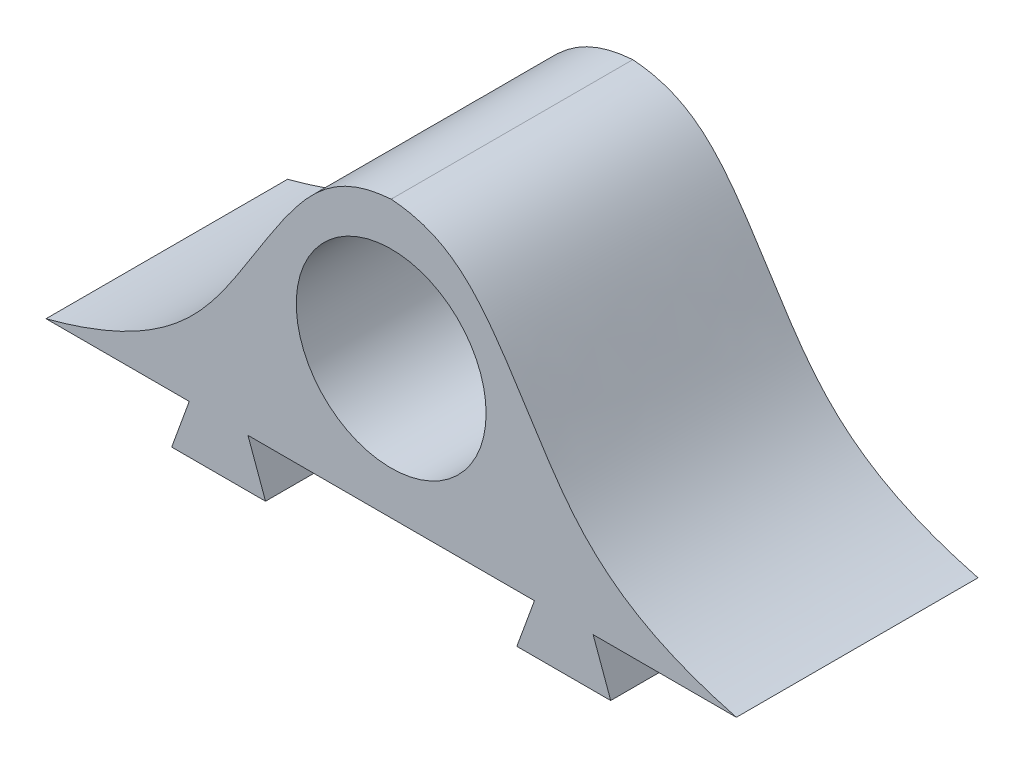
ISO-10303-21;
HEADER;
FILE_DESCRIPTION(('STEP AP214'),'2;1');
FILE_NAME('part.step','',(''),(''),'','','');
FILE_SCHEMA(('AUTOMOTIVE_DESIGN { 1 0 10303 214 1 1 1 1 }'));
ENDSEC;
DATA;
#1=APPLICATION_CONTEXT('core data for automotive mechanical design processes');
#2=APPLICATION_PROTOCOL_DEFINITION('international standard','automotive_design',2000,#1);
#3=PRODUCT_CONTEXT('',#1,'mechanical');
#4=PRODUCT('Part','Part','',(#3));
#5=PRODUCT_RELATED_PRODUCT_CATEGORY('part','',(#4));
#6=PRODUCT_DEFINITION_FORMATION('','',#4);
#7=PRODUCT_DEFINITION_CONTEXT('part definition',#1,'design');
#8=PRODUCT_DEFINITION('design','',#6,#7);
#9=PRODUCT_DEFINITION_SHAPE('','',#8);
#10=(LENGTH_UNIT() NAMED_UNIT(*) SI_UNIT(.MILLI.,.METRE.));
#11=(NAMED_UNIT(*) PLANE_ANGLE_UNIT() SI_UNIT($,.RADIAN.));
#12=(NAMED_UNIT(*) SI_UNIT($,.STERADIAN.) SOLID_ANGLE_UNIT());
#13=UNCERTAINTY_MEASURE_WITH_UNIT(LENGTH_MEASURE(1.E-05),#10,'distance_accuracy_value','');
#14=(GEOMETRIC_REPRESENTATION_CONTEXT(3) GLOBAL_UNCERTAINTY_ASSIGNED_CONTEXT((#13)) GLOBAL_UNIT_ASSIGNED_CONTEXT((#10,
#11,#12)) REPRESENTATION_CONTEXT('',''));
#15=CARTESIAN_POINT('',(0.,0.,0.));
#16=DIRECTION('',(0.,0.,1.));
#17=DIRECTION('',(1.,0.,0.));
#18=AXIS2_PLACEMENT_3D('',#15,#16,#17);
#19=CARTESIAN_POINT('',(-6.35955832797269,-1.4,7.));
#20=DIRECTION('',(0.,1.,0.));
#21=DIRECTION('',(0.,0.,1.));
#22=AXIS2_PLACEMENT_3D('',#19,#20,#21);
#23=PLANE('',#22);
#24=DIRECTION('',(0.,0.,-1.));
#25=VECTOR('',#24,1.);
#26=CARTESIAN_POINT('',(-6.35955832797269,-1.4,7.));
#27=LINE('',#26,#25);
#28=CARTESIAN_POINT('',(-6.35955832797269,-1.4,7.));
#29=VERTEX_POINT('',#28);
#30=CARTESIAN_POINT('',(-6.35955832797269,-1.4,1.9));
#31=VERTEX_POINT('',#30);
#32=EDGE_CURVE('E154',#29,#31,#27,.T.);
#33=ORIENTED_EDGE('',*,*,#32,.T.);
#34=DIRECTION('',(1.,0.,0.));
#35=VECTOR('',#34,1.);
#36=CARTESIAN_POINT('',(-6.5,-1.4,1.9));
#37=LINE('',#36,#35);
#38=CARTESIAN_POINT('',(-3.64044167202731,-1.4,1.9));
#39=VERTEX_POINT('',#38);
#40=EDGE_CURVE('E138',#31,#39,#37,.T.);
#41=ORIENTED_EDGE('',*,*,#40,.T.);
#42=DIRECTION('',(0.,0.,-1.));
#43=VECTOR('',#42,1.);
#44=CARTESIAN_POINT('',(-3.64044167202731,-1.4,7.));
#45=LINE('',#44,#43);
#46=CARTESIAN_POINT('',(-3.64044167202731,-1.4,7.));
#47=VERTEX_POINT('',#46);
#48=EDGE_CURVE('E165',#47,#39,#45,.T.);
#49=ORIENTED_EDGE('',*,*,#48,.F.);
#50=DIRECTION('',(1.,0.,0.));
#51=VECTOR('',#50,1.);
#52=CARTESIAN_POINT('',(-6.35955832797269,-1.4,7.));
#53=LINE('',#52,#51);
#54=EDGE_CURVE('E160',#29,#47,#53,.T.);
#55=ORIENTED_EDGE('',*,*,#54,.F.);
#56=EDGE_LOOP('',(#33,#41,#49,#55));
#57=FACE_BOUND('',#56,.T.);
#58=ADVANCED_FACE('F33',(#57),#23,.F.);
#59=CARTESIAN_POINT('',(6.35955832797269,-1.4,7.));
#60=DIRECTION('',(0.,1.,0.));
#61=DIRECTION('',(0.,0.,1.));
#62=AXIS2_PLACEMENT_3D('',#59,#60,#61);
#63=PLANE('',#62);
#64=DIRECTION('',(0.,0.,-1.));
#65=VECTOR('',#64,1.);
#66=CARTESIAN_POINT('',(3.64044167202731,-1.4,7.));
#67=LINE('',#66,#65);
#68=CARTESIAN_POINT('',(3.64044167202731,-1.4,7.));
#69=VERTEX_POINT('',#68);
#70=CARTESIAN_POINT('',(3.64044167202731,-1.4,1.9));
#71=VERTEX_POINT('',#70);
#72=EDGE_CURVE('E242',#69,#71,#67,.T.);
#73=ORIENTED_EDGE('',*,*,#72,.T.);
#74=CARTESIAN_POINT('',(6.35955832797268,-1.4,1.9));
#75=VERTEX_POINT('',#74);
#76=EDGE_CURVE('E147',#71,#75,#37,.T.);
#77=ORIENTED_EDGE('',*,*,#76,.T.);
#78=DIRECTION('',(0.,0.,-1.));
#79=VECTOR('',#78,1.);
#80=CARTESIAN_POINT('',(6.35955832797269,-1.4,7.));
#81=LINE('',#80,#79);
#82=CARTESIAN_POINT('',(6.35955832797269,-1.4,7.));
#83=VERTEX_POINT('',#82);
#84=EDGE_CURVE('E238',#83,#75,#81,.T.);
#85=ORIENTED_EDGE('',*,*,#84,.F.);
#86=DIRECTION('',(1.,0.,0.));
#87=VECTOR('',#86,1.);
#88=CARTESIAN_POINT('',(6.35955832797269,-1.4,7.));
#89=LINE('',#88,#87);
#90=EDGE_CURVE('E269',#69,#83,#89,.T.);
#91=ORIENTED_EDGE('',*,*,#90,.F.);
#92=EDGE_LOOP('',(#73,#77,#85,#91));
#93=FACE_BOUND('',#92,.T.);
#94=ADVANCED_FACE('F303',(#93),#63,.F.);
#95=CARTESIAN_POINT('',(-3.8123720420899,4.87782875538566,7.));
#96=DIRECTION('',(0.,0.,-1.));
#97=DIRECTION('',(-1.,0.,0.));
#98=AXIS2_PLACEMENT_3D('',#95,#96,#97);
#99=PLANE('',#98);
#100=CARTESIAN_POINT('',(0.,8.,7.));
#101=CARTESIAN_POINT('',(-1.74657401557148,7.86891328282878,7.));
#102=CARTESIAN_POINT('',(-2.70088433635335,6.65428347934177,7.));
#103=CARTESIAN_POINT('',(-5.1424380616311,2.75969482469034,7.));
#104=CARTESIAN_POINT('',(-6.5065999266677,0.914686690082284,7.));
#105=CARTESIAN_POINT('',(-10.,0.,7.));
#106=B_SPLINE_CURVE_WITH_KNOTS('',3,(#100,#101,#102,#103,#104,#105),.UNSPECIFIED.,.F.,.F.,(4,1,
1,4),(0.,0.473494053486383,0.573494053486383,1.),.UNSPECIFIED.);
#107=CARTESIAN_POINT('',(0.,8.,7.));
#108=VERTEX_POINT('',#107);
#109=CARTESIAN_POINT('',(-10.,0.,7.));
#110=VERTEX_POINT('',#109);
#111=EDGE_CURVE('E226',#108,#110,#106,.T.);
#112=ORIENTED_EDGE('',*,*,#111,.T.);
#113=DIRECTION('',(1.,0.,0.));
#114=VECTOR('',#113,1.);
#115=CARTESIAN_POINT('',(-10.,0.,7.));
#116=LINE('',#115,#114);
#117=CARTESIAN_POINT('',(-5.85,0.,7.));
#118=VERTEX_POINT('',#117);
#119=EDGE_CURVE('E175',#110,#118,#116,.T.);
#120=ORIENTED_EDGE('',*,*,#119,.T.);
#121=DIRECTION('',(-0.342020143325673,-0.939692620785907,0.));
#122=VECTOR('',#121,1.);
#123=CARTESIAN_POINT('',(-5.85,0.,7.));
#124=LINE('',#123,#122);
#125=EDGE_CURVE('E264',#118,#29,#124,.T.);
#126=ORIENTED_EDGE('',*,*,#125,.T.);
#127=ORIENTED_EDGE('',*,*,#54,.T.);
#128=DIRECTION('',(-0.342020143325672,0.939692620785907,0.));
#129=VECTOR('',#128,1.);
#130=CARTESIAN_POINT('',(-4.15,0.,7.));
#131=LINE('',#130,#129);
#132=CARTESIAN_POINT('',(-4.15,0.,7.));
#133=VERTEX_POINT('',#132);
#134=EDGE_CURVE('E258',#47,#133,#131,.T.);
#135=ORIENTED_EDGE('',*,*,#134,.T.);
#136=DIRECTION('',(1.,0.,0.));
#137=VECTOR('',#136,1.);
#138=CARTESIAN_POINT('',(-4.15,0.,7.));
#139=LINE('',#138,#137);
#140=CARTESIAN_POINT('',(4.15,0.,7.));
#141=VERTEX_POINT('',#140);
#142=EDGE_CURVE('E260',#133,#141,#139,.T.);
#143=ORIENTED_EDGE('',*,*,#142,.T.);
#144=DIRECTION('',(-0.342020143325672,-0.939692620785907,0.));
#145=VECTOR('',#144,1.);
#146=CARTESIAN_POINT('',(4.15,0.,7.));
#147=LINE('',#146,#145);
#148=EDGE_CURVE('E262',#141,#69,#147,.T.);
#149=ORIENTED_EDGE('',*,*,#148,.T.);
#150=ORIENTED_EDGE('',*,*,#90,.T.);
#151=DIRECTION('',(-0.342020143325672,0.939692620785907,0.));
#152=VECTOR('',#151,1.);
#153=CARTESIAN_POINT('',(5.85,0.,7.));
#154=LINE('',#153,#152);
#155=CARTESIAN_POINT('',(5.85,0.,7.));
#156=VERTEX_POINT('',#155);
#157=EDGE_CURVE('E271',#83,#156,#154,.T.);
#158=ORIENTED_EDGE('',*,*,#157,.T.);
#159=DIRECTION('',(1.,0.,0.));
#160=VECTOR('',#159,1.);
#161=CARTESIAN_POINT('',(5.85,0.,7.));
#162=LINE('',#161,#160);
#163=CARTESIAN_POINT('',(10.,0.,7.));
#164=VERTEX_POINT('',#163);
#165=EDGE_CURVE('E272',#156,#164,#162,.T.);
#166=ORIENTED_EDGE('',*,*,#165,.T.);
#167=CARTESIAN_POINT('',(10.,0.,7.));
#168=CARTESIAN_POINT('',(6.5065999266677,0.914686690082284,7.));
#169=CARTESIAN_POINT('',(5.1424380616311,2.75969482469034,7.));
#170=CARTESIAN_POINT('',(2.70088433635335,6.65428347934177,7.));
#171=CARTESIAN_POINT('',(1.74657401557148,7.86891328282878,7.));
#172=CARTESIAN_POINT('',(0.,8.,7.));
#173=B_SPLINE_CURVE_WITH_KNOTS('',3,(#167,#168,#169,#170,#171,#172),.UNSPECIFIED.,.F.,.F.,(4,1,
1,4),(0.,0.426505946513617,0.526505946513617,1.),.UNSPECIFIED.);
#174=EDGE_CURVE('E195',#164,#108,#173,.T.);
#175=ORIENTED_EDGE('',*,*,#174,.T.);
#176=EDGE_LOOP('',(#112,#120,#126,#127,#135,#143,#149,#150,#158,#166,#175));
#177=FACE_BOUND('',#176,.T.);
#178=CARTESIAN_POINT('',(0.,4.,7.));
#179=DIRECTION('',(0.,0.,1.));
#180=DIRECTION('',(1.,0.,0.));
#181=AXIS2_PLACEMENT_3D('',#178,#179,#180);
#182=CIRCLE('',#181,2.75);
#183=CARTESIAN_POINT('',(2.75,4.,7.));
#184=VERTEX_POINT('',#183);
#185=EDGE_CURVE('E186',#184,#184,#182,.T.);
#186=ORIENTED_EDGE('',*,*,#185,.F.);
#187=EDGE_LOOP('',(#186));
#188=FACE_BOUND('',#187,.T.);
#189=ADVANCED_FACE('F276',(#177,#188),#99,.F.);
#190=CARTESIAN_POINT('',(-3.8123720420899,4.87782875538566,0.));
#191=DIRECTION('',(0.,0.,-1.));
#192=DIRECTION('',(-1.,0.,0.));
#193=AXIS2_PLACEMENT_3D('',#190,#191,#192);
#194=PLANE('',#193);
#195=CARTESIAN_POINT('',(0.,8.,0.));
#196=CARTESIAN_POINT('',(-1.74657401557148,7.86891328282878,0.));
#197=CARTESIAN_POINT('',(-2.70088433635335,6.65428347934177,0.));
#198=CARTESIAN_POINT('',(-5.1424380616311,2.75969482469034,0.));
#199=CARTESIAN_POINT('',(-6.5065999266677,0.914686690082284,0.));
#200=CARTESIAN_POINT('',(-10.,0.,0.));
#201=B_SPLINE_CURVE_WITH_KNOTS('',3,(#195,#196,#197,#198,#199,#200),.UNSPECIFIED.,.F.,.F.,(4,1,
1,4),(0.,0.473494053486383,0.573494053486383,1.),.UNSPECIFIED.);
#202=CARTESIAN_POINT('',(0.,8.,0.));
#203=VERTEX_POINT('',#202);
#204=CARTESIAN_POINT('',(-10.,0.,0.));
#205=VERTEX_POINT('',#204);
#206=EDGE_CURVE('E181',#203,#205,#201,.T.);
#207=ORIENTED_EDGE('',*,*,#206,.F.);
#208=CARTESIAN_POINT('',(10.,0.,0.));
#209=CARTESIAN_POINT('',(6.5065999266677,0.914686690082284,0.));
#210=CARTESIAN_POINT('',(5.1424380616311,2.75969482469034,0.));
#211=CARTESIAN_POINT('',(2.70088433635335,6.65428347934177,0.));
#212=CARTESIAN_POINT('',(1.74657401557148,7.86891328282878,0.));
#213=CARTESIAN_POINT('',(0.,8.,0.));
#214=B_SPLINE_CURVE_WITH_KNOTS('',3,(#208,#209,#210,#211,#212,#213),.UNSPECIFIED.,.F.,.F.,(4,1,
1,4),(0.,0.426505946513617,0.526505946513617,1.),.UNSPECIFIED.);
#215=CARTESIAN_POINT('',(10.,0.,0.));
#216=VERTEX_POINT('',#215);
#217=EDGE_CURVE('E222',#216,#203,#214,.T.);
#218=ORIENTED_EDGE('',*,*,#217,.F.);
#219=DIRECTION('',(1.,0.,0.));
#220=VECTOR('',#219,1.);
#221=CARTESIAN_POINT('',(5.85,0.,0.));
#222=LINE('',#221,#220);
#223=CARTESIAN_POINT('',(5.85,0.,0.));
#224=VERTEX_POINT('',#223);
#225=EDGE_CURVE('E220',#224,#216,#222,.T.);
#226=ORIENTED_EDGE('',*,*,#225,.F.);
#227=DIRECTION('',(-0.342020143325672,0.939692620785907,0.));
#228=VECTOR('',#227,1.);
#229=CARTESIAN_POINT('',(5.85,0.,0.));
#230=LINE('',#229,#228);
#231=CARTESIAN_POINT('',(6.35955832797269,-1.4,0.));
#232=VERTEX_POINT('',#231);
#233=EDGE_CURVE('E218',#232,#224,#230,.T.);
#234=ORIENTED_EDGE('',*,*,#233,.F.);
#235=DIRECTION('',(1.,0.,0.));
#236=VECTOR('',#235,1.);
#237=CARTESIAN_POINT('',(6.35955832797269,-1.4,0.));
#238=LINE('',#237,#236);
#239=CARTESIAN_POINT('',(3.64044167202731,-1.4,0.));
#240=VERTEX_POINT('',#239);
#241=EDGE_CURVE('E215',#240,#232,#238,.T.);
#242=ORIENTED_EDGE('',*,*,#241,.F.);
#243=DIRECTION('',(-0.342020143325672,-0.939692620785907,0.));
#244=VECTOR('',#243,1.);
#245=CARTESIAN_POINT('',(4.15,0.,0.));
#246=LINE('',#245,#244);
#247=CARTESIAN_POINT('',(4.15,0.,0.));
#248=VERTEX_POINT('',#247);
#249=EDGE_CURVE('E212',#248,#240,#246,.T.);
#250=ORIENTED_EDGE('',*,*,#249,.F.);
#251=DIRECTION('',(1.,0.,0.));
#252=VECTOR('',#251,1.);
#253=CARTESIAN_POINT('',(-4.15,0.,0.));
#254=LINE('',#253,#252);
#255=CARTESIAN_POINT('',(-4.15,0.,0.));
#256=VERTEX_POINT('',#255);
#257=EDGE_CURVE('E210',#256,#248,#254,.T.);
#258=ORIENTED_EDGE('',*,*,#257,.F.);
#259=DIRECTION('',(-0.342020143325672,0.939692620785907,0.));
#260=VECTOR('',#259,1.);
#261=CARTESIAN_POINT('',(-4.15,0.,0.));
#262=LINE('',#261,#260);
#263=CARTESIAN_POINT('',(-3.64044167202731,-1.4,0.));
#264=VERTEX_POINT('',#263);
#265=EDGE_CURVE('E208',#264,#256,#262,.T.);
#266=ORIENTED_EDGE('',*,*,#265,.F.);
#267=DIRECTION('',(1.,0.,0.));
#268=VECTOR('',#267,1.);
#269=CARTESIAN_POINT('',(-6.35955832797269,-1.4,0.));
#270=LINE('',#269,#268);
#271=CARTESIAN_POINT('',(-6.35955832797269,-1.4,0.));
#272=VERTEX_POINT('',#271);
#273=EDGE_CURVE('E205',#272,#264,#270,.T.);
#274=ORIENTED_EDGE('',*,*,#273,.F.);
#275=DIRECTION('',(-0.342020143325673,-0.939692620785907,0.));
#276=VECTOR('',#275,1.);
#277=CARTESIAN_POINT('',(-5.85,0.,0.));
#278=LINE('',#277,#276);
#279=CARTESIAN_POINT('',(-5.85,0.,0.));
#280=VERTEX_POINT('',#279);
#281=EDGE_CURVE('E188',#280,#272,#278,.T.);
#282=ORIENTED_EDGE('',*,*,#281,.F.);
#283=DIRECTION('',(1.,0.,0.));
#284=VECTOR('',#283,1.);
#285=CARTESIAN_POINT('',(-10.,0.,0.));
#286=LINE('',#285,#284);
#287=EDGE_CURVE('E174',#205,#280,#286,.T.);
#288=ORIENTED_EDGE('',*,*,#287,.F.);
#289=EDGE_LOOP('',(#207,#218,#226,#234,#242,#250,#258,#266,#274,#282,#288));
#290=FACE_BOUND('',#289,.T.);
#291=CARTESIAN_POINT('',(0.,4.,0.));
#292=DIRECTION('',(0.,0.,1.));
#293=DIRECTION('',(1.,0.,0.));
#294=AXIS2_PLACEMENT_3D('',#291,#292,#293);
#295=CIRCLE('',#294,2.75);
#296=CARTESIAN_POINT('',(2.75,4.,0.));
#297=VERTEX_POINT('',#296);
#298=EDGE_CURVE('E158',#297,#297,#295,.T.);
#299=ORIENTED_EDGE('',*,*,#298,.T.);
#300=EDGE_LOOP('',(#299));
#301=FACE_BOUND('',#300,.T.);
#302=ADVANCED_FACE('F290',(#290,#301),#194,.T.);
#303=DIRECTION('',(0.,0.,-1.));
#304=VECTOR('',#303,1.);
#305=SURFACE_OF_LINEAR_EXTRUSION('',#106,#304);
#306=ORIENTED_EDGE('',*,*,#206,.T.);
#307=DIRECTION('',(0.,0.,-1.));
#308=VECTOR('',#307,1.);
#309=CARTESIAN_POINT('',(-10.,0.,7.));
#310=LINE('',#309,#308);
#311=EDGE_CURVE('E42',#110,#205,#310,.T.);
#312=ORIENTED_EDGE('',*,*,#311,.F.);
#313=ORIENTED_EDGE('',*,*,#111,.F.);
#314=DIRECTION('',(0.,0.,-1.));
#315=VECTOR('',#314,1.);
#316=CARTESIAN_POINT('',(0.,8.,7.));
#317=LINE('',#316,#315);
#318=EDGE_CURVE('E183',#108,#203,#317,.T.);
#319=ORIENTED_EDGE('',*,*,#318,.T.);
#320=EDGE_LOOP('',(#306,#312,#313,#319));
#321=FACE_BOUND('',#320,.T.);
#322=ADVANCED_FACE('F35',(#321),#305,.F.);
#323=CARTESIAN_POINT('',(-10.,0.,7.));
#324=DIRECTION('',(0.,1.,0.));
#325=DIRECTION('',(-1.,0.,0.));
#326=AXIS2_PLACEMENT_3D('',#323,#324,#325);
#327=PLANE('',#326);
#328=ORIENTED_EDGE('',*,*,#287,.T.);
#329=DIRECTION('',(0.,0.,-1.));
#330=VECTOR('',#329,1.);
#331=CARTESIAN_POINT('',(-5.85,0.,7.));
#332=LINE('',#331,#330);
#333=EDGE_CURVE('E161',#118,#280,#332,.T.);
#334=ORIENTED_EDGE('',*,*,#333,.F.);
#335=ORIENTED_EDGE('',*,*,#119,.F.);
#336=ORIENTED_EDGE('',*,*,#311,.T.);
#337=EDGE_LOOP('',(#328,#334,#335,#336));
#338=FACE_BOUND('',#337,.T.);
#339=ADVANCED_FACE('F172',(#338),#327,.F.);
#340=CARTESIAN_POINT('',(-5.85,0.,7.));
#341=DIRECTION('',(0.939692620785907,-0.342020143325673,0.));
#342=DIRECTION('',(0.342020143325673,0.939692620785907,0.));
#343=AXIS2_PLACEMENT_3D('',#340,#341,#342);
#344=PLANE('',#343);
#345=CARTESIAN_POINT('',(-6.35955832797269,-1.4,1.1));
#346=VERTEX_POINT('',#345);
#347=EDGE_CURVE('E157',#346,#272,#27,.T.);
#348=ORIENTED_EDGE('',*,*,#347,.F.);
#349=CARTESIAN_POINT('',(-6.54945971235218,-1.92174976550583,1.5));
#350=DIRECTION('',(0.939692620785907,-0.342020143325673,0.));
#351=DIRECTION('',(0.342020143325673,0.939692620785907,0.));
#352=AXIS2_PLACEMENT_3D('',#349,#350,#351);
#353=ELLIPSE('',#352,0.69962936375178,0.657436550402687);
#354=EDGE_CURVE('E141',#346,#31,#353,.T.);
#355=ORIENTED_EDGE('',*,*,#354,.T.);
#356=ORIENTED_EDGE('',*,*,#32,.F.);
#357=ORIENTED_EDGE('',*,*,#125,.F.);
#358=ORIENTED_EDGE('',*,*,#333,.T.);
#359=ORIENTED_EDGE('',*,*,#281,.T.);
#360=EDGE_LOOP('',(#348,#355,#356,#357,#358,#359));
#361=FACE_BOUND('',#360,.T.);
#362=ADVANCED_FACE('F152',(#361),#344,.F.);
#363=CARTESIAN_POINT('',(-3.64044167202731,-1.4,1.1));
#364=VERTEX_POINT('',#363);
#365=EDGE_CURVE('E249',#364,#264,#45,.T.);
#366=ORIENTED_EDGE('',*,*,#365,.F.);
#367=DIRECTION('',(1.,0.,0.));
#368=VECTOR('',#367,1.);
#369=CARTESIAN_POINT('',(-6.5,-1.4,1.1));
#370=LINE('',#369,#368);
#371=EDGE_CURVE('E49',#346,#364,#370,.T.);
#372=ORIENTED_EDGE('',*,*,#371,.F.);
#373=ORIENTED_EDGE('',*,*,#347,.T.);
#374=ORIENTED_EDGE('',*,*,#273,.T.);
#375=EDGE_LOOP('',(#366,#372,#373,#374));
#376=FACE_BOUND('',#375,.T.);
#377=ADVANCED_FACE('F294',(#376),#23,.F.);
#378=CARTESIAN_POINT('',(-4.15,0.,7.));
#379=DIRECTION('',(-0.939692620785907,-0.342020143325672,0.));
#380=DIRECTION('',(0.342020143325672,-0.939692620785907,0.));
#381=AXIS2_PLACEMENT_3D('',#378,#379,#380);
#382=PLANE('',#381);
#383=ORIENTED_EDGE('',*,*,#48,.T.);
#384=CARTESIAN_POINT('',(-3.45054028764782,-1.92174976550583,1.5));
#385=DIRECTION('',(-0.939692620785907,-0.342020143325672,0.));
#386=DIRECTION('',(0.342020143325672,-0.939692620785907,0.));
#387=AXIS2_PLACEMENT_3D('',#384,#385,#386);
#388=ELLIPSE('',#387,0.69962936375178,0.657436550402687);
#389=EDGE_CURVE('E142',#39,#364,#388,.T.);
#390=ORIENTED_EDGE('',*,*,#389,.T.);
#391=ORIENTED_EDGE('',*,*,#365,.T.);
#392=ORIENTED_EDGE('',*,*,#265,.T.);
#393=DIRECTION('',(0.,0.,-1.));
#394=VECTOR('',#393,1.);
#395=CARTESIAN_POINT('',(-4.15,0.,7.));
#396=LINE('',#395,#394);
#397=EDGE_CURVE('E247',#133,#256,#396,.T.);
#398=ORIENTED_EDGE('',*,*,#397,.F.);
#399=ORIENTED_EDGE('',*,*,#134,.F.);
#400=EDGE_LOOP('',(#383,#390,#391,#392,#398,#399));
#401=FACE_BOUND('',#400,.T.);
#402=ADVANCED_FACE('F257',(#401),#382,.F.);
#403=CARTESIAN_POINT('',(-4.15,0.,7.));
#404=DIRECTION('',(0.,1.,0.));
#405=DIRECTION('',(0.,0.,1.));
#406=AXIS2_PLACEMENT_3D('',#403,#404,#405);
#407=PLANE('',#406);
#408=ORIENTED_EDGE('',*,*,#257,.T.);
#409=DIRECTION('',(0.,0.,-1.));
#410=VECTOR('',#409,1.);
#411=CARTESIAN_POINT('',(4.15,0.,7.));
#412=LINE('',#411,#410);
#413=EDGE_CURVE('E245',#141,#248,#412,.T.);
#414=ORIENTED_EDGE('',*,*,#413,.F.);
#415=ORIENTED_EDGE('',*,*,#142,.F.);
#416=ORIENTED_EDGE('',*,*,#397,.T.);
#417=EDGE_LOOP('',(#408,#414,#415,#416));
#418=FACE_BOUND('',#417,.T.);
#419=ADVANCED_FACE('F346',(#418),#407,.F.);
#420=CARTESIAN_POINT('',(4.15,0.,7.));
#421=DIRECTION('',(0.939692620785907,-0.342020143325672,0.));
#422=DIRECTION('',(0.342020143325672,0.939692620785907,0.));
#423=AXIS2_PLACEMENT_3D('',#420,#421,#422);
#424=PLANE('',#423);
#425=CARTESIAN_POINT('',(3.64044167202731,-1.4,1.1));
#426=VERTEX_POINT('',#425);
#427=EDGE_CURVE('E241',#426,#240,#67,.T.);
#428=ORIENTED_EDGE('',*,*,#427,.F.);
#429=CARTESIAN_POINT('',(3.45054028764782,-1.92174976550583,1.5));
#430=DIRECTION('',(0.939692620785907,-0.342020143325672,0.));
#431=DIRECTION('',(0.342020143325672,0.939692620785907,0.));
#432=AXIS2_PLACEMENT_3D('',#429,#430,#431);
#433=ELLIPSE('',#432,0.69962936375178,0.657436550402687);
#434=EDGE_CURVE('E295',#426,#71,#433,.T.);
#435=ORIENTED_EDGE('',*,*,#434,.T.);
#436=ORIENTED_EDGE('',*,*,#72,.F.);
#437=ORIENTED_EDGE('',*,*,#148,.F.);
#438=ORIENTED_EDGE('',*,*,#413,.T.);
#439=ORIENTED_EDGE('',*,*,#249,.T.);
#440=EDGE_LOOP('',(#428,#435,#436,#437,#438,#439));
#441=FACE_BOUND('',#440,.T.);
#442=ADVANCED_FACE('F315',(#441),#424,.F.);
#443=CARTESIAN_POINT('',(6.35955832797269,-1.4,1.1));
#444=VERTEX_POINT('',#443);
#445=EDGE_CURVE('E237',#444,#232,#81,.T.);
#446=ORIENTED_EDGE('',*,*,#445,.F.);
#447=EDGE_CURVE('E57',#426,#444,#370,.T.);
#448=ORIENTED_EDGE('',*,*,#447,.F.);
#449=ORIENTED_EDGE('',*,*,#427,.T.);
#450=ORIENTED_EDGE('',*,*,#241,.T.);
#451=EDGE_LOOP('',(#446,#448,#449,#450));
#452=FACE_BOUND('',#451,.T.);
#453=ADVANCED_FACE('F318',(#452),#63,.F.);
#454=CARTESIAN_POINT('',(5.85,0.,7.));
#455=DIRECTION('',(-0.939692620785907,-0.342020143325672,0.));
#456=DIRECTION('',(0.342020143325672,-0.939692620785907,0.));
#457=AXIS2_PLACEMENT_3D('',#454,#455,#456);
#458=PLANE('',#457);
#459=ORIENTED_EDGE('',*,*,#84,.T.);
#460=CARTESIAN_POINT('',(6.54945971235218,-1.92174976550583,1.5));
#461=DIRECTION('',(-0.939692620785907,-0.342020143325672,0.));
#462=DIRECTION('',(0.342020143325672,-0.939692620785907,0.));
#463=AXIS2_PLACEMENT_3D('',#460,#461,#462);
#464=ELLIPSE('',#463,0.69962936375178,0.657436550402687);
#465=EDGE_CURVE('E11',#75,#444,#464,.T.);
#466=ORIENTED_EDGE('',*,*,#465,.T.);
#467=ORIENTED_EDGE('',*,*,#445,.T.);
#468=ORIENTED_EDGE('',*,*,#233,.T.);
#469=DIRECTION('',(0.,0.,-1.));
#470=VECTOR('',#469,1.);
#471=CARTESIAN_POINT('',(5.85,0.,7.));
#472=LINE('',#471,#470);
#473=EDGE_CURVE('E234',#156,#224,#472,.T.);
#474=ORIENTED_EDGE('',*,*,#473,.F.);
#475=ORIENTED_EDGE('',*,*,#157,.F.);
#476=EDGE_LOOP('',(#459,#466,#467,#468,#474,#475));
#477=FACE_BOUND('',#476,.T.);
#478=ADVANCED_FACE('F308',(#477),#458,.F.);
#479=CARTESIAN_POINT('',(5.85,0.,7.));
#480=DIRECTION('',(0.,1.,0.));
#481=DIRECTION('',(-1.,0.,0.));
#482=AXIS2_PLACEMENT_3D('',#479,#480,#481);
#483=PLANE('',#482);
#484=ORIENTED_EDGE('',*,*,#225,.T.);
#485=DIRECTION('',(0.,0.,-1.));
#486=VECTOR('',#485,1.);
#487=CARTESIAN_POINT('',(10.,0.,7.));
#488=LINE('',#487,#486);
#489=EDGE_CURVE('E231',#164,#216,#488,.T.);
#490=ORIENTED_EDGE('',*,*,#489,.F.);
#491=ORIENTED_EDGE('',*,*,#165,.F.);
#492=ORIENTED_EDGE('',*,*,#473,.T.);
#493=EDGE_LOOP('',(#484,#490,#491,#492));
#494=FACE_BOUND('',#493,.T.);
#495=ADVANCED_FACE('F323',(#494),#483,.F.);
#496=DIRECTION('',(0.,0.,-1.));
#497=VECTOR('',#496,1.);
#498=SURFACE_OF_LINEAR_EXTRUSION('',#173,#497);
#499=ORIENTED_EDGE('',*,*,#217,.T.);
#500=ORIENTED_EDGE('',*,*,#318,.F.);
#501=ORIENTED_EDGE('',*,*,#174,.F.);
#502=ORIENTED_EDGE('',*,*,#489,.T.);
#503=EDGE_LOOP('',(#499,#500,#501,#502));
#504=FACE_BOUND('',#503,.T.);
#505=ADVANCED_FACE('F279',(#504),#498,.F.);
#506=CARTESIAN_POINT('',(0.,4.,7.));
#507=DIRECTION('',(0.,0.,-1.));
#508=DIRECTION('',(-1.,0.,0.));
#509=AXIS2_PLACEMENT_3D('',#506,#507,#508);
#510=CYLINDRICAL_SURFACE('',#509,2.75);
#511=ORIENTED_EDGE('',*,*,#185,.T.);
#512=EDGE_LOOP('',(#511));
#513=FACE_BOUND('',#512,.T.);
#514=ORIENTED_EDGE('',*,*,#298,.F.);
#515=EDGE_LOOP('',(#514));
#516=FACE_BOUND('',#515,.T.);
#517=ADVANCED_FACE('F330',(#513,#516),#510,.F.);
#518=CARTESIAN_POINT('',(-6.5,-1.92174976550583,1.5));
#519=DIRECTION('',(1.,0.,0.));
#520=DIRECTION('',(0.,0.,-1.));
#521=AXIS2_PLACEMENT_3D('',#518,#519,#520);
#522=CYLINDRICAL_SURFACE('',#521,0.657436550402687);
#523=ORIENTED_EDGE('',*,*,#447,.T.);
#524=ORIENTED_EDGE('',*,*,#465,.F.);
#525=ORIENTED_EDGE('',*,*,#76,.F.);
#526=ORIENTED_EDGE('',*,*,#434,.F.);
#527=EDGE_LOOP('',(#523,#524,#525,#526));
#528=FACE_BOUND('',#527,.T.);
#529=ADVANCED_FACE('F316',(#528),#522,.F.);
#530=ORIENTED_EDGE('',*,*,#371,.T.);
#531=ORIENTED_EDGE('',*,*,#389,.F.);
#532=ORIENTED_EDGE('',*,*,#40,.F.);
#533=ORIENTED_EDGE('',*,*,#354,.F.);
#534=EDGE_LOOP('',(#530,#531,#532,#533));
#535=FACE_BOUND('',#534,.T.);
#536=ADVANCED_FACE('F140',(#535),#522,.F.);
#537=CLOSED_SHELL('',(#58,#94,#189,#302,#322,#339,#362,#377,#402,#419,#442,#453,#478,#495,#505,
#517,#529,#536));
#538=MANIFOLD_SOLID_BREP('B2',#537);
#539=ADVANCED_BREP_SHAPE_REPRESENTATION('',(#18,#538),#14);
#540=SHAPE_DEFINITION_REPRESENTATION(#9,#539);
ENDSEC;
END-ISO-10303-21;
